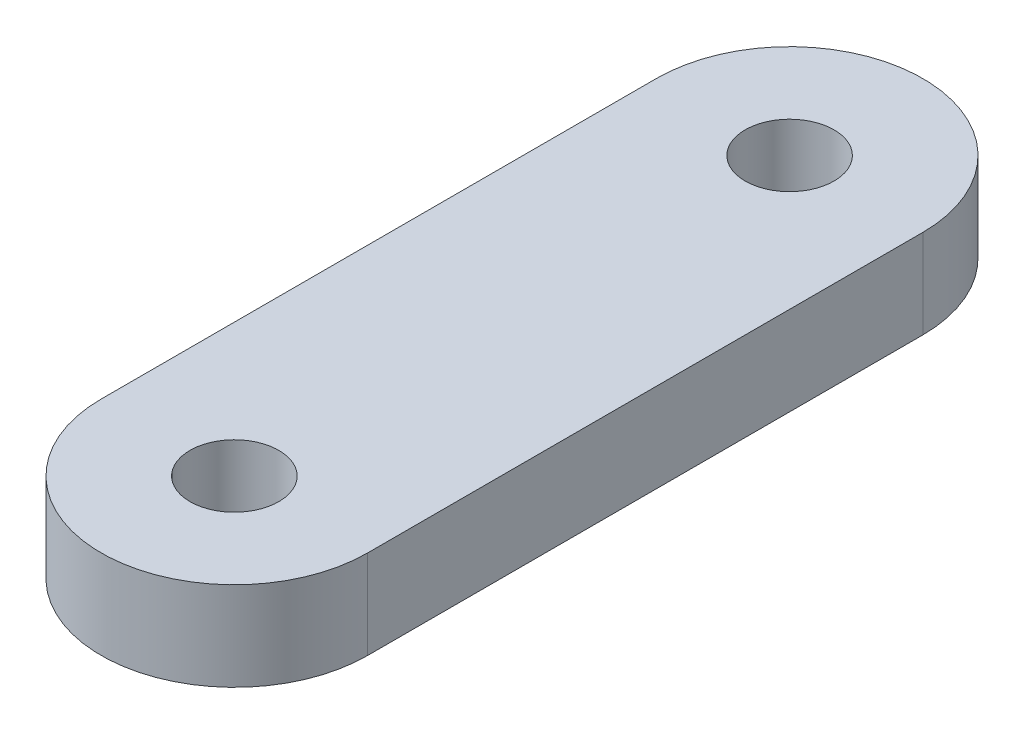
ISO-10303-21;
HEADER;
FILE_DESCRIPTION(('STEP AP214'),'2;1');
FILE_NAME('part.step','',(''),(''),'','','');
FILE_SCHEMA(('AUTOMOTIVE_DESIGN { 1 0 10303 214 1 1 1 1 }'));
ENDSEC;
DATA;
#1=APPLICATION_CONTEXT('core data for automotive mechanical design processes');
#2=APPLICATION_PROTOCOL_DEFINITION('international standard','automotive_design',2000,#1);
#3=PRODUCT_CONTEXT('',#1,'mechanical');
#4=PRODUCT('Part','Part','',(#3));
#5=PRODUCT_RELATED_PRODUCT_CATEGORY('part','',(#4));
#6=PRODUCT_DEFINITION_FORMATION('','',#4);
#7=PRODUCT_DEFINITION_CONTEXT('part definition',#1,'design');
#8=PRODUCT_DEFINITION('design','',#6,#7);
#9=PRODUCT_DEFINITION_SHAPE('','',#8);
#10=(LENGTH_UNIT() NAMED_UNIT(*) SI_UNIT(.MILLI.,.METRE.));
#11=(NAMED_UNIT(*) PLANE_ANGLE_UNIT() SI_UNIT($,.RADIAN.));
#12=(NAMED_UNIT(*) SI_UNIT($,.STERADIAN.) SOLID_ANGLE_UNIT());
#13=UNCERTAINTY_MEASURE_WITH_UNIT(LENGTH_MEASURE(1.E-05),#10,'distance_accuracy_value','');
#14=(GEOMETRIC_REPRESENTATION_CONTEXT(3) GLOBAL_UNCERTAINTY_ASSIGNED_CONTEXT((#13)) GLOBAL_UNIT_ASSIGNED_CONTEXT((#10,
#11,#12)) REPRESENTATION_CONTEXT('',''));
#15=CARTESIAN_POINT('',(0.,0.,0.));
#16=DIRECTION('',(0.,0.,1.));
#17=DIRECTION('',(1.,0.,0.));
#18=AXIS2_PLACEMENT_3D('',#15,#16,#17);
#19=CARTESIAN_POINT('',(0.,4.,-12.5));
#20=DIRECTION('',(0.,-1.,0.));
#21=DIRECTION('',(0.,0.,-1.));
#22=AXIS2_PLACEMENT_3D('',#19,#20,#21);
#23=CYLINDRICAL_SURFACE('',#22,5.99999999999999);
#24=CARTESIAN_POINT('',(0.,0.,-12.5));
#25=DIRECTION('',(0.,1.,0.));
#26=DIRECTION('',(0.,0.,1.));
#27=AXIS2_PLACEMENT_3D('',#24,#25,#26);
#28=CIRCLE('',#27,5.99999999999999);
#29=CARTESIAN_POINT('',(5.99999999999999,0.,-12.5));
#30=VERTEX_POINT('',#29);
#31=CARTESIAN_POINT('',(-6.,0.,-12.5));
#32=VERTEX_POINT('',#31);
#33=EDGE_CURVE('E102',#30,#32,#28,.T.);
#34=ORIENTED_EDGE('',*,*,#33,.T.);
#35=DIRECTION('',(0.,-1.,0.));
#36=VECTOR('',#35,1.);
#37=CARTESIAN_POINT('',(-6.,4.,-12.5));
#38=LINE('',#37,#36);
#39=CARTESIAN_POINT('',(-6.,4.,-12.5));
#40=VERTEX_POINT('',#39);
#41=EDGE_CURVE('E11',#40,#32,#38,.T.);
#42=ORIENTED_EDGE('',*,*,#41,.F.);
#43=CARTESIAN_POINT('',(0.,4.,-12.5));
#44=DIRECTION('',(0.,1.,0.));
#45=DIRECTION('',(0.,0.,1.));
#46=AXIS2_PLACEMENT_3D('',#43,#44,#45);
#47=CIRCLE('',#46,5.99999999999999);
#48=CARTESIAN_POINT('',(5.99999999999999,4.,-12.5));
#49=VERTEX_POINT('',#48);
#50=EDGE_CURVE('E90',#49,#40,#47,.T.);
#51=ORIENTED_EDGE('',*,*,#50,.F.);
#52=DIRECTION('',(0.,-1.,0.));
#53=VECTOR('',#52,1.);
#54=CARTESIAN_POINT('',(5.99999999999999,4.,-12.5));
#55=LINE('',#54,#53);
#56=EDGE_CURVE('E98',#49,#30,#55,.T.);
#57=ORIENTED_EDGE('',*,*,#56,.T.);
#58=EDGE_LOOP('',(#34,#42,#51,#57));
#59=FACE_BOUND('',#58,.T.);
#60=ADVANCED_FACE('F39',(#59),#23,.T.);
#61=CARTESIAN_POINT('',(-6.,4.,-12.5));
#62=DIRECTION('',(1.,0.,0.));
#63=DIRECTION('',(0.,0.,-1.));
#64=AXIS2_PLACEMENT_3D('',#61,#62,#63);
#65=PLANE('',#64);
#66=DIRECTION('',(0.,0.,1.));
#67=VECTOR('',#66,1.);
#68=CARTESIAN_POINT('',(-6.,0.,-12.5));
#69=LINE('',#68,#67);
#70=CARTESIAN_POINT('',(-5.99999999999999,0.,12.5));
#71=VERTEX_POINT('',#70);
#72=EDGE_CURVE('E94',#32,#71,#69,.T.);
#73=ORIENTED_EDGE('',*,*,#72,.T.);
#74=DIRECTION('',(0.,-1.,0.));
#75=VECTOR('',#74,1.);
#76=CARTESIAN_POINT('',(-5.99999999999999,4.,12.5));
#77=LINE('',#76,#75);
#78=CARTESIAN_POINT('',(-5.99999999999999,4.,12.5));
#79=VERTEX_POINT('',#78);
#80=EDGE_CURVE('E47',#79,#71,#77,.T.);
#81=ORIENTED_EDGE('',*,*,#80,.F.);
#82=DIRECTION('',(0.,0.,1.));
#83=VECTOR('',#82,1.);
#84=CARTESIAN_POINT('',(-6.,4.,-12.5));
#85=LINE('',#84,#83);
#86=EDGE_CURVE('E85',#40,#79,#85,.T.);
#87=ORIENTED_EDGE('',*,*,#86,.F.);
#88=ORIENTED_EDGE('',*,*,#41,.T.);
#89=EDGE_LOOP('',(#73,#81,#87,#88));
#90=FACE_BOUND('',#89,.T.);
#91=ADVANCED_FACE('F93',(#90),#65,.F.);
#92=CARTESIAN_POINT('',(0.,4.,12.5));
#93=DIRECTION('',(0.,-1.,0.));
#94=DIRECTION('',(0.,0.,-1.));
#95=AXIS2_PLACEMENT_3D('',#92,#93,#94);
#96=CYLINDRICAL_SURFACE('',#95,5.99999999999999);
#97=CARTESIAN_POINT('',(0.,0.,12.5));
#98=DIRECTION('',(0.,1.,0.));
#99=DIRECTION('',(0.,0.,1.));
#100=AXIS2_PLACEMENT_3D('',#97,#98,#99);
#101=CIRCLE('',#100,5.99999999999999);
#102=CARTESIAN_POINT('',(6.,0.,12.5));
#103=VERTEX_POINT('',#102);
#104=EDGE_CURVE('E72',#71,#103,#101,.T.);
#105=ORIENTED_EDGE('',*,*,#104,.T.);
#106=DIRECTION('',(0.,-1.,0.));
#107=VECTOR('',#106,1.);
#108=CARTESIAN_POINT('',(6.,4.,12.5));
#109=LINE('',#108,#107);
#110=CARTESIAN_POINT('',(6.,4.,12.5));
#111=VERTEX_POINT('',#110);
#112=EDGE_CURVE('E95',#111,#103,#109,.T.);
#113=ORIENTED_EDGE('',*,*,#112,.F.);
#114=CARTESIAN_POINT('',(0.,4.,12.5));
#115=DIRECTION('',(0.,1.,0.));
#116=DIRECTION('',(0.,0.,1.));
#117=AXIS2_PLACEMENT_3D('',#114,#115,#116);
#118=CIRCLE('',#117,5.99999999999999);
#119=EDGE_CURVE('E88',#79,#111,#118,.T.);
#120=ORIENTED_EDGE('',*,*,#119,.F.);
#121=ORIENTED_EDGE('',*,*,#80,.T.);
#122=EDGE_LOOP('',(#105,#113,#120,#121));
#123=FACE_BOUND('',#122,.T.);
#124=ADVANCED_FACE('F96',(#123),#96,.T.);
#125=CARTESIAN_POINT('',(5.99999999999999,4.,-12.5));
#126=DIRECTION('',(-1.,0.,0.));
#127=DIRECTION('',(0.,0.,1.));
#128=AXIS2_PLACEMENT_3D('',#125,#126,#127);
#129=PLANE('',#128);
#130=DIRECTION('',(0.,0.,-1.));
#131=VECTOR('',#130,1.);
#132=CARTESIAN_POINT('',(5.99999999999999,0.,-12.5));
#133=LINE('',#132,#131);
#134=EDGE_CURVE('E78',#103,#30,#133,.T.);
#135=ORIENTED_EDGE('',*,*,#134,.T.);
#136=ORIENTED_EDGE('',*,*,#56,.F.);
#137=DIRECTION('',(0.,0.,-1.));
#138=VECTOR('',#137,1.);
#139=CARTESIAN_POINT('',(5.99999999999999,4.,-12.5));
#140=LINE('',#139,#138);
#141=EDGE_CURVE('E55',#111,#49,#140,.T.);
#142=ORIENTED_EDGE('',*,*,#141,.F.);
#143=ORIENTED_EDGE('',*,*,#112,.T.);
#144=EDGE_LOOP('',(#135,#136,#142,#143));
#145=FACE_BOUND('',#144,.T.);
#146=ADVANCED_FACE('F110',(#145),#129,.F.);
#147=CARTESIAN_POINT('',(0.,4.,-12.5));
#148=DIRECTION('',(0.,1.,0.));
#149=DIRECTION('',(0.,0.,1.));
#150=AXIS2_PLACEMENT_3D('',#147,#148,#149);
#151=PLANE('',#150);
#152=CARTESIAN_POINT('',(0.,4.,12.5));
#153=DIRECTION('',(0.,1.,0.));
#154=DIRECTION('',(0.,0.,1.));
#155=AXIS2_PLACEMENT_3D('',#152,#153,#154);
#156=CIRCLE('',#155,2.);
#157=CARTESIAN_POINT('',(0.,4.,14.5));
#158=VERTEX_POINT('',#157);
#159=EDGE_CURVE('E122',#158,#158,#156,.T.);
#160=ORIENTED_EDGE('',*,*,#159,.F.);
#161=EDGE_LOOP('',(#160));
#162=FACE_BOUND('',#161,.T.);
#163=CARTESIAN_POINT('',(0.,4.,-12.5));
#164=DIRECTION('',(0.,1.,0.));
#165=DIRECTION('',(0.,0.,1.));
#166=AXIS2_PLACEMENT_3D('',#163,#164,#165);
#167=CIRCLE('',#166,2.);
#168=CARTESIAN_POINT('',(0.,4.,-10.5));
#169=VERTEX_POINT('',#168);
#170=EDGE_CURVE('E116',#169,#169,#167,.T.);
#171=ORIENTED_EDGE('',*,*,#170,.F.);
#172=EDGE_LOOP('',(#171));
#173=FACE_BOUND('',#172,.T.);
#174=ORIENTED_EDGE('',*,*,#50,.T.);
#175=ORIENTED_EDGE('',*,*,#86,.T.);
#176=ORIENTED_EDGE('',*,*,#119,.T.);
#177=ORIENTED_EDGE('',*,*,#141,.T.);
#178=EDGE_LOOP('',(#174,#175,#176,#177));
#179=FACE_BOUND('',#178,.T.);
#180=ADVANCED_FACE('F86',(#162,#173,#179),#151,.T.);
#181=CARTESIAN_POINT('',(0.,0.,-12.5));
#182=DIRECTION('',(0.,1.,0.));
#183=DIRECTION('',(0.,0.,1.));
#184=AXIS2_PLACEMENT_3D('',#181,#182,#183);
#185=PLANE('',#184);
#186=CARTESIAN_POINT('',(0.,0.,12.5));
#187=DIRECTION('',(0.,1.,0.));
#188=DIRECTION('',(0.,0.,1.));
#189=AXIS2_PLACEMENT_3D('',#186,#187,#188);
#190=CIRCLE('',#189,2.);
#191=CARTESIAN_POINT('',(0.,0.,14.5));
#192=VERTEX_POINT('',#191);
#193=EDGE_CURVE('E119',#192,#192,#190,.T.);
#194=ORIENTED_EDGE('',*,*,#193,.T.);
#195=EDGE_LOOP('',(#194));
#196=FACE_BOUND('',#195,.T.);
#197=CARTESIAN_POINT('',(0.,0.,-12.5));
#198=DIRECTION('',(0.,1.,0.));
#199=DIRECTION('',(0.,0.,1.));
#200=AXIS2_PLACEMENT_3D('',#197,#198,#199);
#201=CIRCLE('',#200,2.);
#202=CARTESIAN_POINT('',(0.,0.,-10.5));
#203=VERTEX_POINT('',#202);
#204=EDGE_CURVE('E105',#203,#203,#201,.T.);
#205=ORIENTED_EDGE('',*,*,#204,.T.);
#206=EDGE_LOOP('',(#205));
#207=FACE_BOUND('',#206,.T.);
#208=ORIENTED_EDGE('',*,*,#33,.F.);
#209=ORIENTED_EDGE('',*,*,#134,.F.);
#210=ORIENTED_EDGE('',*,*,#104,.F.);
#211=ORIENTED_EDGE('',*,*,#72,.F.);
#212=EDGE_LOOP('',(#208,#209,#210,#211));
#213=FACE_BOUND('',#212,.T.);
#214=ADVANCED_FACE('F113',(#196,#207,#213),#185,.F.);
#215=CARTESIAN_POINT('',(0.,0.,-12.5));
#216=DIRECTION('',(0.,1.,0.));
#217=DIRECTION('',(0.,0.,1.));
#218=AXIS2_PLACEMENT_3D('',#215,#216,#217);
#219=CYLINDRICAL_SURFACE('',#218,2.);
#220=ORIENTED_EDGE('',*,*,#204,.F.);
#221=EDGE_LOOP('',(#220));
#222=FACE_BOUND('',#221,.T.);
#223=ORIENTED_EDGE('',*,*,#170,.T.);
#224=EDGE_LOOP('',(#223));
#225=FACE_BOUND('',#224,.T.);
#226=ADVANCED_FACE('F133',(#222,#225),#219,.F.);
#227=CARTESIAN_POINT('',(0.,0.,12.5));
#228=DIRECTION('',(0.,1.,0.));
#229=DIRECTION('',(0.,0.,1.));
#230=AXIS2_PLACEMENT_3D('',#227,#228,#229);
#231=CYLINDRICAL_SURFACE('',#230,2.);
#232=ORIENTED_EDGE('',*,*,#193,.F.);
#233=EDGE_LOOP('',(#232));
#234=FACE_BOUND('',#233,.T.);
#235=ORIENTED_EDGE('',*,*,#159,.T.);
#236=EDGE_LOOP('',(#235));
#237=FACE_BOUND('',#236,.T.);
#238=ADVANCED_FACE('F130',(#234,#237),#231,.F.);
#239=CLOSED_SHELL('',(#60,#91,#124,#146,#180,#214,#226,#238));
#240=MANIFOLD_SOLID_BREP('B2',#239);
#241=ADVANCED_BREP_SHAPE_REPRESENTATION('',(#18,#240),#14);
#242=SHAPE_DEFINITION_REPRESENTATION(#9,#241);
ENDSEC;
END-ISO-10303-21;
